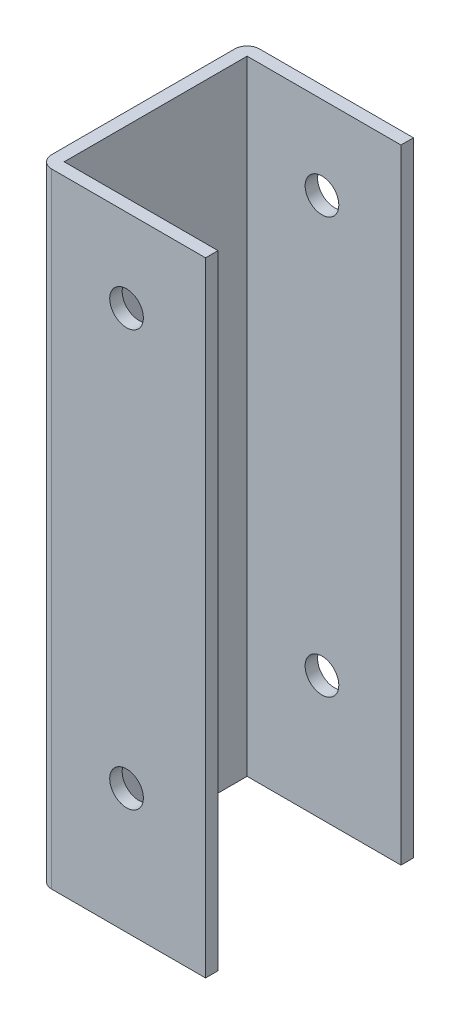
ISO-10303-21;
HEADER;
FILE_DESCRIPTION(('STEP AP214'),'2;1');
FILE_NAME('part.step','',(''),(''),'','','');
FILE_SCHEMA(('AUTOMOTIVE_DESIGN { 1 0 10303 214 1 1 1 1 }'));
ENDSEC;
DATA;
#1=APPLICATION_CONTEXT('core data for automotive mechanical design processes');
#2=APPLICATION_PROTOCOL_DEFINITION('international standard','automotive_design',2000,#1);
#3=PRODUCT_CONTEXT('',#1,'mechanical');
#4=PRODUCT('Part','Part','',(#3));
#5=PRODUCT_RELATED_PRODUCT_CATEGORY('part','',(#4));
#6=PRODUCT_DEFINITION_FORMATION('','',#4);
#7=PRODUCT_DEFINITION_CONTEXT('part definition',#1,'design');
#8=PRODUCT_DEFINITION('design','',#6,#7);
#9=PRODUCT_DEFINITION_SHAPE('','',#8);
#10=(LENGTH_UNIT() NAMED_UNIT(*) SI_UNIT(.MILLI.,.METRE.));
#11=(NAMED_UNIT(*) PLANE_ANGLE_UNIT() SI_UNIT($,.RADIAN.));
#12=(NAMED_UNIT(*) SI_UNIT($,.STERADIAN.) SOLID_ANGLE_UNIT());
#13=UNCERTAINTY_MEASURE_WITH_UNIT(LENGTH_MEASURE(1.E-05),#10,'distance_accuracy_value','');
#14=(GEOMETRIC_REPRESENTATION_CONTEXT(3) GLOBAL_UNCERTAINTY_ASSIGNED_CONTEXT((#13)) GLOBAL_UNIT_ASSIGNED_CONTEXT((#10,
#11,#12)) REPRESENTATION_CONTEXT('',''));
#15=CARTESIAN_POINT('',(0.,0.,0.));
#16=DIRECTION('',(0.,0.,1.));
#17=DIRECTION('',(1.,0.,0.));
#18=AXIS2_PLACEMENT_3D('',#15,#16,#17);
#19=CARTESIAN_POINT('',(-37.,150.,-22.));
#20=DIRECTION('',(0.,1.,0.));
#21=DIRECTION('',(0.,0.,1.));
#22=AXIS2_PLACEMENT_3D('',#19,#20,#21);
#23=PLANE('',#22);
#24=DIRECTION('',(0.,0.,1.));
#25=VECTOR('',#24,1.);
#26=CARTESIAN_POINT('',(0.,150.,27.4206114717656));
#27=LINE('',#26,#25);
#28=CARTESIAN_POINT('',(0.,150.,-25.));
#29=VERTEX_POINT('',#28);
#30=CARTESIAN_POINT('',(0.,150.,-22.));
#31=VERTEX_POINT('',#30);
#32=EDGE_CURVE('E96',#29,#31,#27,.T.);
#33=ORIENTED_EDGE('',*,*,#32,.F.);
#34=DIRECTION('',(-1.,0.,0.));
#35=VECTOR('',#34,1.);
#36=CARTESIAN_POINT('',(-37.,150.,-25.));
#37=LINE('',#36,#35);
#38=CARTESIAN_POINT('',(-37.,150.,-25.));
#39=VERTEX_POINT('',#38);
#40=EDGE_CURVE('E161',#29,#39,#37,.T.);
#41=ORIENTED_EDGE('',*,*,#40,.T.);
#42=CARTESIAN_POINT('',(-37.,150.,-22.));
#43=DIRECTION('',(0.,1.,0.));
#44=DIRECTION('',(0.,0.,1.));
#45=AXIS2_PLACEMENT_3D('',#42,#43,#44);
#46=CIRCLE('',#45,3.);
#47=CARTESIAN_POINT('',(-40.,150.,-22.));
#48=VERTEX_POINT('',#47);
#49=EDGE_CURVE('E192',#39,#48,#46,.T.);
#50=ORIENTED_EDGE('',*,*,#49,.T.);
#51=DIRECTION('',(0.,0.,1.));
#52=VECTOR('',#51,1.);
#53=CARTESIAN_POINT('',(-40.,150.,-22.));
#54=LINE('',#53,#52);
#55=CARTESIAN_POINT('',(-40.,150.,22.));
#56=VERTEX_POINT('',#55);
#57=EDGE_CURVE('E243',#48,#56,#54,.T.);
#58=ORIENTED_EDGE('',*,*,#57,.T.);
#59=CARTESIAN_POINT('',(-37.,150.,22.));
#60=DIRECTION('',(0.,1.,0.));
#61=DIRECTION('',(0.,0.,1.));
#62=AXIS2_PLACEMENT_3D('',#59,#60,#61);
#63=CIRCLE('',#62,3.);
#64=CARTESIAN_POINT('',(-37.,150.,25.));
#65=VERTEX_POINT('',#64);
#66=EDGE_CURVE('E176',#56,#65,#63,.T.);
#67=ORIENTED_EDGE('',*,*,#66,.T.);
#68=DIRECTION('',(1.,0.,0.));
#69=VECTOR('',#68,1.);
#70=CARTESIAN_POINT('',(-37.,150.,25.));
#71=LINE('',#70,#69);
#72=CARTESIAN_POINT('',(0.,150.,25.));
#73=VERTEX_POINT('',#72);
#74=EDGE_CURVE('E171',#65,#73,#71,.T.);
#75=ORIENTED_EDGE('',*,*,#74,.T.);
#76=CARTESIAN_POINT('',(0.,150.,22.));
#77=VERTEX_POINT('',#76);
#78=EDGE_CURVE('E165',#77,#73,#27,.T.);
#79=ORIENTED_EDGE('',*,*,#78,.F.);
#80=DIRECTION('',(1.,0.,0.));
#81=VECTOR('',#80,1.);
#82=CARTESIAN_POINT('',(-37.,150.,22.));
#83=LINE('',#82,#81);
#84=CARTESIAN_POINT('',(-37.,150.,22.));
#85=VERTEX_POINT('',#84);
#86=EDGE_CURVE('E226',#85,#77,#83,.T.);
#87=ORIENTED_EDGE('',*,*,#86,.F.);
#88=DIRECTION('',(0.,0.,1.));
#89=VECTOR('',#88,1.);
#90=CARTESIAN_POINT('',(-37.,150.,-22.));
#91=LINE('',#90,#89);
#92=CARTESIAN_POINT('',(-37.,150.,-22.));
#93=VERTEX_POINT('',#92);
#94=EDGE_CURVE('E224',#93,#85,#91,.T.);
#95=ORIENTED_EDGE('',*,*,#94,.F.);
#96=DIRECTION('',(-1.,0.,0.));
#97=VECTOR('',#96,1.);
#98=CARTESIAN_POINT('',(-37.,150.,-22.));
#99=LINE('',#98,#97);
#100=EDGE_CURVE('E164',#31,#93,#99,.T.);
#101=ORIENTED_EDGE('',*,*,#100,.F.);
#102=EDGE_LOOP('',(#33,#41,#50,#58,#67,#75,#79,#87,#95,#101));
#103=FACE_BOUND('',#102,.T.);
#104=ADVANCED_FACE('F72',(#103),#23,.T.);
#105=CARTESIAN_POINT('',(-37.,0.,-22.));
#106=DIRECTION('',(0.,1.,0.));
#107=DIRECTION('',(0.,0.,1.));
#108=AXIS2_PLACEMENT_3D('',#105,#106,#107);
#109=PLANE('',#108);
#110=DIRECTION('',(-1.,0.,0.));
#111=VECTOR('',#110,1.);
#112=CARTESIAN_POINT('',(-37.,0.,-25.));
#113=LINE('',#112,#111);
#114=CARTESIAN_POINT('',(0.,0.,-25.));
#115=VERTEX_POINT('',#114);
#116=CARTESIAN_POINT('',(-37.,0.,-25.));
#117=VERTEX_POINT('',#116);
#118=EDGE_CURVE('E191',#115,#117,#113,.T.);
#119=ORIENTED_EDGE('',*,*,#118,.F.);
#120=DIRECTION('',(0.,0.,1.));
#121=VECTOR('',#120,1.);
#122=CARTESIAN_POINT('',(0.,0.,27.4206114717656));
#123=LINE('',#122,#121);
#124=CARTESIAN_POINT('',(0.,0.,-22.));
#125=VERTEX_POINT('',#124);
#126=EDGE_CURVE('E151',#115,#125,#123,.T.);
#127=ORIENTED_EDGE('',*,*,#126,.T.);
#128=DIRECTION('',(-1.,0.,0.));
#129=VECTOR('',#128,1.);
#130=CARTESIAN_POINT('',(-37.,0.,-22.));
#131=LINE('',#130,#129);
#132=CARTESIAN_POINT('',(-37.,0.,-22.));
#133=VERTEX_POINT('',#132);
#134=EDGE_CURVE('E227',#125,#133,#131,.T.);
#135=ORIENTED_EDGE('',*,*,#134,.T.);
#136=DIRECTION('',(0.,0.,1.));
#137=VECTOR('',#136,1.);
#138=CARTESIAN_POINT('',(-37.,0.,-22.));
#139=LINE('',#138,#137);
#140=CARTESIAN_POINT('',(-37.,0.,22.));
#141=VERTEX_POINT('',#140);
#142=EDGE_CURVE('E223',#133,#141,#139,.T.);
#143=ORIENTED_EDGE('',*,*,#142,.T.);
#144=DIRECTION('',(1.,0.,0.));
#145=VECTOR('',#144,1.);
#146=CARTESIAN_POINT('',(-37.,0.,22.));
#147=LINE('',#146,#145);
#148=CARTESIAN_POINT('',(0.,0.,22.));
#149=VERTEX_POINT('',#148);
#150=EDGE_CURVE('E234',#141,#149,#147,.T.);
#151=ORIENTED_EDGE('',*,*,#150,.T.);
#152=CARTESIAN_POINT('',(0.,0.,25.));
#153=VERTEX_POINT('',#152);
#154=EDGE_CURVE('E89',#149,#153,#123,.T.);
#155=ORIENTED_EDGE('',*,*,#154,.T.);
#156=DIRECTION('',(1.,0.,0.));
#157=VECTOR('',#156,1.);
#158=CARTESIAN_POINT('',(-37.,0.,25.));
#159=LINE('',#158,#157);
#160=CARTESIAN_POINT('',(-37.,0.,25.));
#161=VERTEX_POINT('',#160);
#162=EDGE_CURVE('E188',#161,#153,#159,.T.);
#163=ORIENTED_EDGE('',*,*,#162,.F.);
#164=CARTESIAN_POINT('',(-37.,0.,22.));
#165=DIRECTION('',(0.,1.,0.));
#166=DIRECTION('',(0.,0.,1.));
#167=AXIS2_PLACEMENT_3D('',#164,#165,#166);
#168=CIRCLE('',#167,3.);
#169=CARTESIAN_POINT('',(-40.,0.,22.));
#170=VERTEX_POINT('',#169);
#171=EDGE_CURVE('E186',#170,#161,#168,.T.);
#172=ORIENTED_EDGE('',*,*,#171,.F.);
#173=DIRECTION('',(0.,0.,1.));
#174=VECTOR('',#173,1.);
#175=CARTESIAN_POINT('',(-40.,0.,-22.));
#176=LINE('',#175,#174);
#177=CARTESIAN_POINT('',(-40.,0.,-22.));
#178=VERTEX_POINT('',#177);
#179=EDGE_CURVE('E183',#178,#170,#176,.T.);
#180=ORIENTED_EDGE('',*,*,#179,.F.);
#181=CARTESIAN_POINT('',(-37.,0.,-22.));
#182=DIRECTION('',(0.,1.,0.));
#183=DIRECTION('',(0.,0.,1.));
#184=AXIS2_PLACEMENT_3D('',#181,#182,#183);
#185=CIRCLE('',#184,3.);
#186=EDGE_CURVE('E180',#117,#178,#185,.T.);
#187=ORIENTED_EDGE('',*,*,#186,.F.);
#188=EDGE_LOOP('',(#119,#127,#135,#143,#151,#155,#163,#172,#180,#187));
#189=FACE_BOUND('',#188,.T.);
#190=ADVANCED_FACE('F257',(#189),#109,.F.);
#191=CARTESIAN_POINT('',(-37.,150.,-22.));
#192=DIRECTION('',(0.,-1.,0.));
#193=DIRECTION('',(0.,0.,-1.));
#194=AXIS2_PLACEMENT_3D('',#191,#192,#193);
#195=CYLINDRICAL_SURFACE('',#194,3.);
#196=ORIENTED_EDGE('',*,*,#186,.T.);
#197=DIRECTION('',(0.,-1.,0.));
#198=VECTOR('',#197,1.);
#199=CARTESIAN_POINT('',(-40.,150.,-22.));
#200=LINE('',#199,#198);
#201=EDGE_CURVE('E81',#48,#178,#200,.T.);
#202=ORIENTED_EDGE('',*,*,#201,.F.);
#203=ORIENTED_EDGE('',*,*,#49,.F.);
#204=DIRECTION('',(0.,-1.,0.));
#205=VECTOR('',#204,1.);
#206=CARTESIAN_POINT('',(-37.,150.,-25.));
#207=LINE('',#206,#205);
#208=EDGE_CURVE('E169',#39,#117,#207,.T.);
#209=ORIENTED_EDGE('',*,*,#208,.T.);
#210=EDGE_LOOP('',(#196,#202,#203,#209));
#211=FACE_BOUND('',#210,.T.);
#212=ADVANCED_FACE('F74',(#211),#195,.T.);
#213=CARTESIAN_POINT('',(-40.,150.,-22.));
#214=DIRECTION('',(1.,0.,0.));
#215=DIRECTION('',(0.,0.,-1.));
#216=AXIS2_PLACEMENT_3D('',#213,#214,#215);
#217=PLANE('',#216);
#218=ORIENTED_EDGE('',*,*,#179,.T.);
#219=DIRECTION('',(0.,-1.,0.));
#220=VECTOR('',#219,1.);
#221=CARTESIAN_POINT('',(-40.,150.,22.));
#222=LINE('',#221,#220);
#223=EDGE_CURVE('E196',#56,#170,#222,.T.);
#224=ORIENTED_EDGE('',*,*,#223,.F.);
#225=ORIENTED_EDGE('',*,*,#57,.F.);
#226=ORIENTED_EDGE('',*,*,#201,.T.);
#227=EDGE_LOOP('',(#218,#224,#225,#226));
#228=FACE_BOUND('',#227,.T.);
#229=ADVANCED_FACE('F273',(#228),#217,.F.);
#230=CARTESIAN_POINT('',(-37.,150.,22.));
#231=DIRECTION('',(0.,-1.,0.));
#232=DIRECTION('',(0.,0.,-1.));
#233=AXIS2_PLACEMENT_3D('',#230,#231,#232);
#234=CYLINDRICAL_SURFACE('',#233,3.);
#235=ORIENTED_EDGE('',*,*,#171,.T.);
#236=DIRECTION('',(0.,-1.,0.));
#237=VECTOR('',#236,1.);
#238=CARTESIAN_POINT('',(-37.,150.,25.));
#239=LINE('',#238,#237);
#240=EDGE_CURVE('E173',#65,#161,#239,.T.);
#241=ORIENTED_EDGE('',*,*,#240,.F.);
#242=ORIENTED_EDGE('',*,*,#66,.F.);
#243=ORIENTED_EDGE('',*,*,#223,.T.);
#244=EDGE_LOOP('',(#235,#241,#242,#243));
#245=FACE_BOUND('',#244,.T.);
#246=ADVANCED_FACE('F250',(#245),#234,.T.);
#247=CARTESIAN_POINT('',(-37.,150.,25.));
#248=DIRECTION('',(0.,0.,-1.));
#249=DIRECTION('',(-1.,0.,0.));
#250=AXIS2_PLACEMENT_3D('',#247,#248,#249);
#251=PLANE('',#250);
#252=CARTESIAN_POINT('',(-19.,29.9999999999999,25.));
#253=DIRECTION('',(0.,0.,-1.));
#254=DIRECTION('',(-1.,0.,0.));
#255=AXIS2_PLACEMENT_3D('',#252,#253,#254);
#256=CIRCLE('',#255,4.05000000000002);
#257=CARTESIAN_POINT('',(-23.05,29.9999999999999,25.));
#258=VERTEX_POINT('',#257);
#259=EDGE_CURVE('E298',#258,#258,#256,.T.);
#260=ORIENTED_EDGE('',*,*,#259,.T.);
#261=EDGE_LOOP('',(#260));
#262=FACE_BOUND('',#261,.T.);
#263=CARTESIAN_POINT('',(-19.,130.,25.));
#264=DIRECTION('',(0.,0.,-1.));
#265=DIRECTION('',(-1.,0.,0.));
#266=AXIS2_PLACEMENT_3D('',#263,#264,#265);
#267=CIRCLE('',#266,4.05000000000008);
#268=CARTESIAN_POINT('',(-23.0500000000001,130.,25.));
#269=VERTEX_POINT('',#268);
#270=EDGE_CURVE('E203',#269,#269,#267,.T.);
#271=ORIENTED_EDGE('',*,*,#270,.T.);
#272=EDGE_LOOP('',(#271));
#273=FACE_BOUND('',#272,.T.);
#274=ORIENTED_EDGE('',*,*,#162,.T.);
#275=DIRECTION('',(0.,1.,0.));
#276=VECTOR('',#275,1.);
#277=CARTESIAN_POINT('',(0.,150.,25.));
#278=LINE('',#277,#276);
#279=EDGE_CURVE('E155',#153,#73,#278,.T.);
#280=ORIENTED_EDGE('',*,*,#279,.T.);
#281=ORIENTED_EDGE('',*,*,#74,.F.);
#282=ORIENTED_EDGE('',*,*,#240,.T.);
#283=EDGE_LOOP('',(#274,#280,#281,#282));
#284=FACE_BOUND('',#283,.T.);
#285=ADVANCED_FACE('F254',(#262,#273,#284),#251,.F.);
#286=CARTESIAN_POINT('',(-37.,150.,-25.));
#287=DIRECTION('',(0.,0.,1.));
#288=DIRECTION('',(1.,0.,0.));
#289=AXIS2_PLACEMENT_3D('',#286,#287,#288);
#290=PLANE('',#289);
#291=CARTESIAN_POINT('',(-19.,29.9999999999999,-25.));
#292=DIRECTION('',(0.,0.,-1.));
#293=DIRECTION('',(-1.,0.,0.));
#294=AXIS2_PLACEMENT_3D('',#291,#292,#293);
#295=CIRCLE('',#294,4.05000000000002);
#296=CARTESIAN_POINT('',(-23.05,29.9999999999999,-25.));
#297=VERTEX_POINT('',#296);
#298=EDGE_CURVE('E300',#297,#297,#295,.T.);
#299=ORIENTED_EDGE('',*,*,#298,.F.);
#300=EDGE_LOOP('',(#299));
#301=FACE_BOUND('',#300,.T.);
#302=CARTESIAN_POINT('',(-19.,130.,-25.));
#303=DIRECTION('',(0.,0.,-1.));
#304=DIRECTION('',(-1.,0.,0.));
#305=AXIS2_PLACEMENT_3D('',#302,#303,#304);
#306=CIRCLE('',#305,4.05000000000008);
#307=CARTESIAN_POINT('',(-23.0500000000001,130.,-25.));
#308=VERTEX_POINT('',#307);
#309=EDGE_CURVE('E209',#308,#308,#306,.T.);
#310=ORIENTED_EDGE('',*,*,#309,.F.);
#311=EDGE_LOOP('',(#310));
#312=FACE_BOUND('',#311,.T.);
#313=ORIENTED_EDGE('',*,*,#40,.F.);
#314=DIRECTION('',(0.,-1.,0.));
#315=VECTOR('',#314,1.);
#316=CARTESIAN_POINT('',(0.,150.,-25.));
#317=LINE('',#316,#315);
#318=EDGE_CURVE('E148',#29,#115,#317,.T.);
#319=ORIENTED_EDGE('',*,*,#318,.T.);
#320=ORIENTED_EDGE('',*,*,#118,.T.);
#321=ORIENTED_EDGE('',*,*,#208,.F.);
#322=EDGE_LOOP('',(#313,#319,#320,#321));
#323=FACE_BOUND('',#322,.T.);
#324=ADVANCED_FACE('F167',(#301,#312,#323),#290,.F.);
#325=CARTESIAN_POINT('',(-37.,150.,-22.));
#326=DIRECTION('',(1.,0.,0.));
#327=DIRECTION('',(0.,0.,-1.));
#328=AXIS2_PLACEMENT_3D('',#325,#326,#327);
#329=PLANE('',#328);
#330=ORIENTED_EDGE('',*,*,#142,.F.);
#331=DIRECTION('',(0.,-1.,0.));
#332=VECTOR('',#331,1.);
#333=CARTESIAN_POINT('',(-37.,150.,-22.));
#334=LINE('',#333,#332);
#335=EDGE_CURVE('E231',#93,#133,#334,.T.);
#336=ORIENTED_EDGE('',*,*,#335,.F.);
#337=ORIENTED_EDGE('',*,*,#94,.T.);
#338=DIRECTION('',(0.,-1.,0.));
#339=VECTOR('',#338,1.);
#340=CARTESIAN_POINT('',(-37.,150.,22.));
#341=LINE('',#340,#339);
#342=EDGE_CURVE('E184',#85,#141,#341,.T.);
#343=ORIENTED_EDGE('',*,*,#342,.T.);
#344=EDGE_LOOP('',(#330,#336,#337,#343));
#345=FACE_BOUND('',#344,.T.);
#346=ADVANCED_FACE('F264',(#345),#329,.T.);
#347=CARTESIAN_POINT('',(-37.,150.,22.));
#348=DIRECTION('',(0.,0.,-1.));
#349=DIRECTION('',(-1.,0.,0.));
#350=AXIS2_PLACEMENT_3D('',#347,#348,#349);
#351=PLANE('',#350);
#352=CARTESIAN_POINT('',(-19.,29.9999999999999,22.));
#353=DIRECTION('',(0.,0.,-1.));
#354=DIRECTION('',(-1.,0.,0.));
#355=AXIS2_PLACEMENT_3D('',#352,#353,#354);
#356=CIRCLE('',#355,4.05000000000002);
#357=CARTESIAN_POINT('',(-23.05,29.9999999999999,22.));
#358=VERTEX_POINT('',#357);
#359=EDGE_CURVE('E214',#358,#358,#356,.T.);
#360=ORIENTED_EDGE('',*,*,#359,.F.);
#361=EDGE_LOOP('',(#360));
#362=FACE_BOUND('',#361,.T.);
#363=CARTESIAN_POINT('',(-19.,130.,22.));
#364=DIRECTION('',(0.,0.,-1.));
#365=DIRECTION('',(-1.,0.,0.));
#366=AXIS2_PLACEMENT_3D('',#363,#364,#365);
#367=CIRCLE('',#366,4.05000000000008);
#368=CARTESIAN_POINT('',(-23.0500000000001,130.,22.));
#369=VERTEX_POINT('',#368);
#370=EDGE_CURVE('E202',#369,#369,#367,.T.);
#371=ORIENTED_EDGE('',*,*,#370,.F.);
#372=EDGE_LOOP('',(#371));
#373=FACE_BOUND('',#372,.T.);
#374=DIRECTION('',(0.,1.,0.));
#375=VECTOR('',#374,1.);
#376=CARTESIAN_POINT('',(0.,150.,22.));
#377=LINE('',#376,#375);
#378=EDGE_CURVE('E156',#149,#77,#377,.T.);
#379=ORIENTED_EDGE('',*,*,#378,.F.);
#380=ORIENTED_EDGE('',*,*,#150,.F.);
#381=ORIENTED_EDGE('',*,*,#342,.F.);
#382=ORIENTED_EDGE('',*,*,#86,.T.);
#383=EDGE_LOOP('',(#379,#380,#381,#382));
#384=FACE_BOUND('',#383,.T.);
#385=ADVANCED_FACE('F261',(#362,#373,#384),#351,.T.);
#386=CARTESIAN_POINT('',(-37.,150.,-22.));
#387=DIRECTION('',(0.,0.,1.));
#388=DIRECTION('',(1.,0.,0.));
#389=AXIS2_PLACEMENT_3D('',#386,#387,#388);
#390=PLANE('',#389);
#391=CARTESIAN_POINT('',(-19.,29.9999999999999,-22.));
#392=DIRECTION('',(0.,0.,1.));
#393=DIRECTION('',(1.,0.,0.));
#394=AXIS2_PLACEMENT_3D('',#391,#392,#393);
#395=CIRCLE('',#394,4.05000000000002);
#396=CARTESIAN_POINT('',(-14.95,29.9999999999999,-22.));
#397=VERTEX_POINT('',#396);
#398=EDGE_CURVE('E76',#397,#397,#395,.T.);
#399=ORIENTED_EDGE('',*,*,#398,.F.);
#400=EDGE_LOOP('',(#399));
#401=FACE_BOUND('',#400,.T.);
#402=CARTESIAN_POINT('',(-19.,130.,-22.));
#403=DIRECTION('',(0.,0.,1.));
#404=DIRECTION('',(1.,0.,0.));
#405=AXIS2_PLACEMENT_3D('',#402,#403,#404);
#406=CIRCLE('',#405,4.05000000000008);
#407=CARTESIAN_POINT('',(-14.9499999999999,130.,-22.));
#408=VERTEX_POINT('',#407);
#409=EDGE_CURVE('E200',#408,#408,#406,.T.);
#410=ORIENTED_EDGE('',*,*,#409,.F.);
#411=EDGE_LOOP('',(#410));
#412=FACE_BOUND('',#411,.T.);
#413=DIRECTION('',(0.,-1.,0.));
#414=VECTOR('',#413,1.);
#415=CARTESIAN_POINT('',(0.,150.,-22.));
#416=LINE('',#415,#414);
#417=EDGE_CURVE('E12',#31,#125,#416,.T.);
#418=ORIENTED_EDGE('',*,*,#417,.F.);
#419=ORIENTED_EDGE('',*,*,#100,.T.);
#420=ORIENTED_EDGE('',*,*,#335,.T.);
#421=ORIENTED_EDGE('',*,*,#134,.F.);
#422=EDGE_LOOP('',(#418,#419,#420,#421));
#423=FACE_BOUND('',#422,.T.);
#424=ADVANCED_FACE('F268',(#401,#412,#423),#390,.T.);
#425=CARTESIAN_POINT('',(0.,0.,27.4206114717656));
#426=DIRECTION('',(-1.,0.,0.));
#427=DIRECTION('',(0.,0.,1.));
#428=AXIS2_PLACEMENT_3D('',#425,#426,#427);
#429=PLANE('',#428);
#430=ORIENTED_EDGE('',*,*,#32,.T.);
#431=ORIENTED_EDGE('',*,*,#417,.T.);
#432=ORIENTED_EDGE('',*,*,#126,.F.);
#433=ORIENTED_EDGE('',*,*,#318,.F.);
#434=EDGE_LOOP('',(#430,#431,#432,#433));
#435=FACE_BOUND('',#434,.T.);
#436=ADVANCED_FACE('F149',(#435),#429,.F.);
#437=ORIENTED_EDGE('',*,*,#154,.F.);
#438=ORIENTED_EDGE('',*,*,#378,.T.);
#439=ORIENTED_EDGE('',*,*,#78,.T.);
#440=ORIENTED_EDGE('',*,*,#279,.F.);
#441=EDGE_LOOP('',(#437,#438,#439,#440));
#442=FACE_BOUND('',#441,.T.);
#443=ADVANCED_FACE('F255',(#442),#429,.F.);
#444=CARTESIAN_POINT('',(-19.,130.,25.));
#445=DIRECTION('',(0.,0.,-1.));
#446=DIRECTION('',(-1.,0.,0.));
#447=AXIS2_PLACEMENT_3D('',#444,#445,#446);
#448=CYLINDRICAL_SURFACE('',#447,4.05000000000008);
#449=ORIENTED_EDGE('',*,*,#409,.T.);
#450=EDGE_LOOP('',(#449));
#451=FACE_BOUND('',#450,.T.);
#452=ORIENTED_EDGE('',*,*,#309,.T.);
#453=EDGE_LOOP('',(#452));
#454=FACE_BOUND('',#453,.T.);
#455=ADVANCED_FACE('F310',(#451,#454),#448,.F.);
#456=ORIENTED_EDGE('',*,*,#370,.T.);
#457=EDGE_LOOP('',(#456));
#458=FACE_BOUND('',#457,.T.);
#459=ORIENTED_EDGE('',*,*,#270,.F.);
#460=EDGE_LOOP('',(#459));
#461=FACE_BOUND('',#460,.T.);
#462=ADVANCED_FACE('F312',(#458,#461),#448,.F.);
#463=CARTESIAN_POINT('',(-19.,29.9999999999999,25.));
#464=DIRECTION('',(0.,0.,-1.));
#465=DIRECTION('',(-1.,0.,0.));
#466=AXIS2_PLACEMENT_3D('',#463,#464,#465);
#467=CYLINDRICAL_SURFACE('',#466,4.05000000000002);
#468=ORIENTED_EDGE('',*,*,#398,.T.);
#469=EDGE_LOOP('',(#468));
#470=FACE_BOUND('',#469,.T.);
#471=ORIENTED_EDGE('',*,*,#298,.T.);
#472=EDGE_LOOP('',(#471));
#473=FACE_BOUND('',#472,.T.);
#474=ADVANCED_FACE('F306',(#470,#473),#467,.F.);
#475=ORIENTED_EDGE('',*,*,#359,.T.);
#476=EDGE_LOOP('',(#475));
#477=FACE_BOUND('',#476,.T.);
#478=ORIENTED_EDGE('',*,*,#259,.F.);
#479=EDGE_LOOP('',(#478));
#480=FACE_BOUND('',#479,.T.);
#481=ADVANCED_FACE('F335',(#477,#480),#467,.F.);
#482=CLOSED_SHELL('',(#104,#190,#212,#229,#246,#285,#324,#346,#385,#424,#436,#443,#455,#462,
#474,#481));
#483=MANIFOLD_SOLID_BREP('B2',#482);
#484=ADVANCED_BREP_SHAPE_REPRESENTATION('',(#18,#483),#14);
#485=SHAPE_DEFINITION_REPRESENTATION(#9,#484);
ENDSEC;
END-ISO-10303-21;
